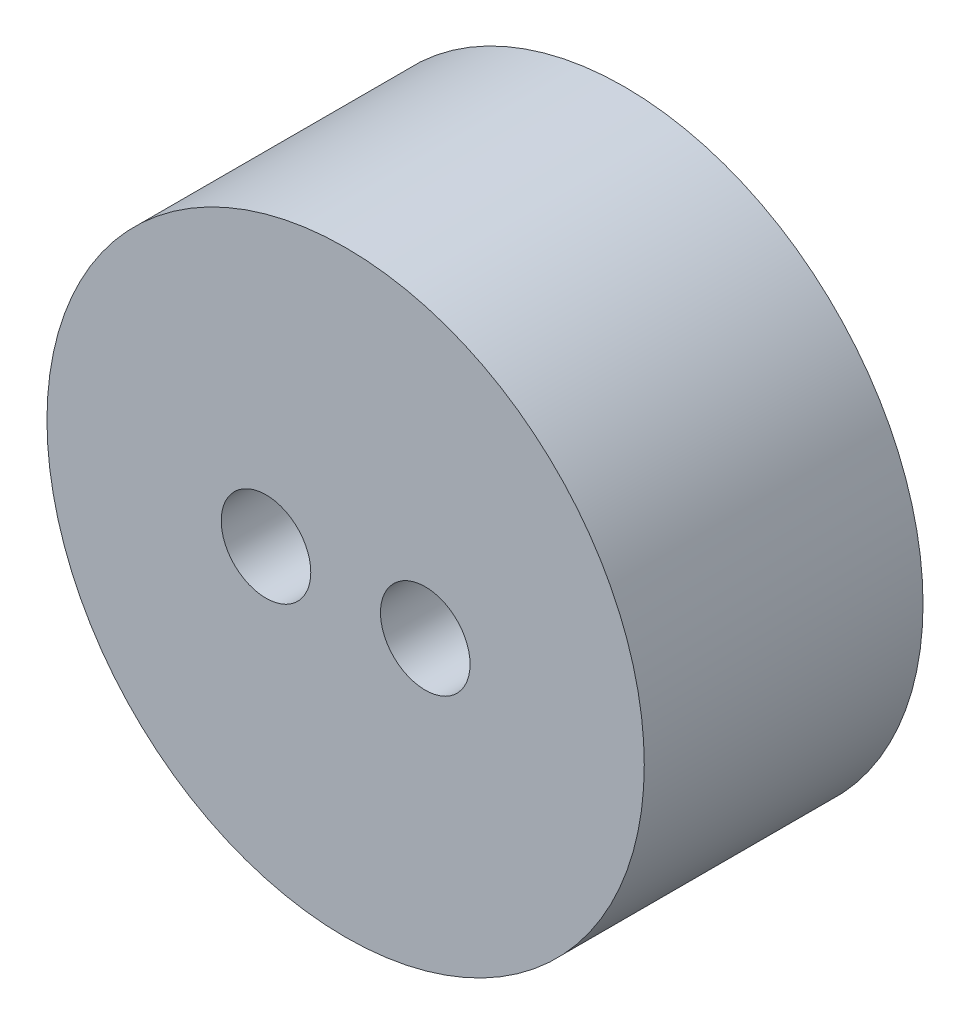
ISO-10303-21;
HEADER;
FILE_DESCRIPTION(('STEP AP214'),'2;1');
FILE_NAME('part.step','',(''),(''),'','','');
FILE_SCHEMA(('AUTOMOTIVE_DESIGN { 1 0 10303 214 1 1 1 1 }'));
ENDSEC;
DATA;
#1=APPLICATION_CONTEXT('core data for automotive mechanical design processes');
#2=APPLICATION_PROTOCOL_DEFINITION('international standard','automotive_design',2000,#1);
#3=PRODUCT_CONTEXT('',#1,'mechanical');
#4=PRODUCT('Part','Part','',(#3));
#5=PRODUCT_RELATED_PRODUCT_CATEGORY('part','',(#4));
#6=PRODUCT_DEFINITION_FORMATION('','',#4);
#7=PRODUCT_DEFINITION_CONTEXT('part definition',#1,'design');
#8=PRODUCT_DEFINITION('design','',#6,#7);
#9=PRODUCT_DEFINITION_SHAPE('','',#8);
#10=(LENGTH_UNIT() NAMED_UNIT(*) SI_UNIT(.MILLI.,.METRE.));
#11=(NAMED_UNIT(*) PLANE_ANGLE_UNIT() SI_UNIT($,.RADIAN.));
#12=(NAMED_UNIT(*) SI_UNIT($,.STERADIAN.) SOLID_ANGLE_UNIT());
#13=UNCERTAINTY_MEASURE_WITH_UNIT(LENGTH_MEASURE(1.E-05),#10,'distance_accuracy_value','');
#14=(GEOMETRIC_REPRESENTATION_CONTEXT(3) GLOBAL_UNCERTAINTY_ASSIGNED_CONTEXT((#13)) GLOBAL_UNIT_ASSIGNED_CONTEXT((#10,
#11,#12)) REPRESENTATION_CONTEXT('',''));
#15=CARTESIAN_POINT('',(0.,0.,0.));
#16=DIRECTION('',(0.,0.,1.));
#17=DIRECTION('',(1.,0.,0.));
#18=AXIS2_PLACEMENT_3D('',#15,#16,#17);
#19=CARTESIAN_POINT('',(0.,0.,14.));
#20=DIRECTION('',(0.,0.,-1.));
#21=DIRECTION('',(-1.,0.,0.));
#22=AXIS2_PLACEMENT_3D('',#19,#20,#21);
#23=CYLINDRICAL_SURFACE('',#22,15.);
#24=CARTESIAN_POINT('',(0.,0.,14.));
#25=DIRECTION('',(0.,0.,1.));
#26=DIRECTION('',(1.,0.,0.));
#27=AXIS2_PLACEMENT_3D('',#24,#25,#26);
#28=CIRCLE('',#27,15.);
#29=CARTESIAN_POINT('',(15.,0.,14.));
#30=VERTEX_POINT('',#29);
#31=EDGE_CURVE('E10',#30,#30,#28,.T.);
#32=ORIENTED_EDGE('',*,*,#31,.F.);
#33=EDGE_LOOP('',(#32));
#34=FACE_BOUND('',#33,.T.);
#35=CARTESIAN_POINT('',(0.,0.,0.));
#36=DIRECTION('',(0.,0.,1.));
#37=DIRECTION('',(1.,0.,0.));
#38=AXIS2_PLACEMENT_3D('',#35,#36,#37);
#39=CIRCLE('',#38,15.);
#40=CARTESIAN_POINT('',(15.,0.,0.));
#41=VERTEX_POINT('',#40);
#42=EDGE_CURVE('E34',#41,#41,#39,.T.);
#43=ORIENTED_EDGE('',*,*,#42,.T.);
#44=EDGE_LOOP('',(#43));
#45=FACE_BOUND('',#44,.T.);
#46=ADVANCED_FACE('F31',(#34,#45),#23,.T.);
#47=CARTESIAN_POINT('',(0.,0.,14.));
#48=DIRECTION('',(0.,0.,1.));
#49=DIRECTION('',(1.,0.,0.));
#50=AXIS2_PLACEMENT_3D('',#47,#48,#49);
#51=PLANE('',#50);
#52=CARTESIAN_POINT('',(-4.,0.,14.));
#53=DIRECTION('',(0.,0.,1.));
#54=DIRECTION('',(1.,0.,0.));
#55=AXIS2_PLACEMENT_3D('',#52,#53,#54);
#56=CIRCLE('',#55,2.25);
#57=CARTESIAN_POINT('',(-1.75,0.,14.));
#58=VERTEX_POINT('',#57);
#59=EDGE_CURVE('E51',#58,#58,#56,.T.);
#60=ORIENTED_EDGE('',*,*,#59,.F.);
#61=EDGE_LOOP('',(#60));
#62=FACE_BOUND('',#61,.T.);
#63=CARTESIAN_POINT('',(4.,0.,14.));
#64=DIRECTION('',(0.,0.,1.));
#65=DIRECTION('',(1.,0.,0.));
#66=AXIS2_PLACEMENT_3D('',#63,#64,#65);
#67=CIRCLE('',#66,2.25);
#68=CARTESIAN_POINT('',(6.25,0.,14.));
#69=VERTEX_POINT('',#68);
#70=EDGE_CURVE('E45',#69,#69,#67,.T.);
#71=ORIENTED_EDGE('',*,*,#70,.F.);
#72=EDGE_LOOP('',(#71));
#73=FACE_BOUND('',#72,.T.);
#74=ORIENTED_EDGE('',*,*,#31,.T.);
#75=EDGE_LOOP('',(#74));
#76=FACE_BOUND('',#75,.T.);
#77=ADVANCED_FACE('F57',(#62,#73,#76),#51,.T.);
#78=CARTESIAN_POINT('',(0.,0.,0.));
#79=DIRECTION('',(0.,0.,1.));
#80=DIRECTION('',(1.,0.,0.));
#81=AXIS2_PLACEMENT_3D('',#78,#79,#80);
#82=PLANE('',#81);
#83=CARTESIAN_POINT('',(-4.,0.,0.));
#84=DIRECTION('',(0.,0.,1.));
#85=DIRECTION('',(1.,0.,0.));
#86=AXIS2_PLACEMENT_3D('',#83,#84,#85);
#87=CIRCLE('',#86,2.25);
#88=CARTESIAN_POINT('',(-1.75,0.,0.));
#89=VERTEX_POINT('',#88);
#90=EDGE_CURVE('E48',#89,#89,#87,.T.);
#91=ORIENTED_EDGE('',*,*,#90,.T.);
#92=EDGE_LOOP('',(#91));
#93=FACE_BOUND('',#92,.T.);
#94=CARTESIAN_POINT('',(4.,0.,0.));
#95=DIRECTION('',(0.,0.,1.));
#96=DIRECTION('',(1.,0.,0.));
#97=AXIS2_PLACEMENT_3D('',#94,#95,#96);
#98=CIRCLE('',#97,2.25);
#99=CARTESIAN_POINT('',(6.25,0.,0.));
#100=VERTEX_POINT('',#99);
#101=EDGE_CURVE('E41',#100,#100,#98,.T.);
#102=ORIENTED_EDGE('',*,*,#101,.T.);
#103=EDGE_LOOP('',(#102));
#104=FACE_BOUND('',#103,.T.);
#105=ORIENTED_EDGE('',*,*,#42,.F.);
#106=EDGE_LOOP('',(#105));
#107=FACE_BOUND('',#106,.T.);
#108=ADVANCED_FACE('F60',(#93,#104,#107),#82,.F.);
#109=CARTESIAN_POINT('',(4.,0.,14.));
#110=DIRECTION('',(0.,0.,1.));
#111=DIRECTION('',(1.,0.,0.));
#112=AXIS2_PLACEMENT_3D('',#109,#110,#111);
#113=CYLINDRICAL_SURFACE('',#112,2.25);
#114=ORIENTED_EDGE('',*,*,#101,.F.);
#115=EDGE_LOOP('',(#114));
#116=FACE_BOUND('',#115,.T.);
#117=ORIENTED_EDGE('',*,*,#70,.T.);
#118=EDGE_LOOP('',(#117));
#119=FACE_BOUND('',#118,.T.);
#120=ADVANCED_FACE('F64',(#116,#119),#113,.F.);
#121=CARTESIAN_POINT('',(-4.,0.,14.));
#122=DIRECTION('',(0.,0.,1.));
#123=DIRECTION('',(1.,0.,0.));
#124=AXIS2_PLACEMENT_3D('',#121,#122,#123);
#125=CYLINDRICAL_SURFACE('',#124,2.25);
#126=ORIENTED_EDGE('',*,*,#90,.F.);
#127=EDGE_LOOP('',(#126));
#128=FACE_BOUND('',#127,.T.);
#129=ORIENTED_EDGE('',*,*,#59,.T.);
#130=EDGE_LOOP('',(#129));
#131=FACE_BOUND('',#130,.T.);
#132=ADVANCED_FACE('F55',(#128,#131),#125,.F.);
#133=CLOSED_SHELL('',(#46,#77,#108,#120,#132));
#134=MANIFOLD_SOLID_BREP('B2',#133);
#135=ADVANCED_BREP_SHAPE_REPRESENTATION('',(#18,#134),#14);
#136=SHAPE_DEFINITION_REPRESENTATION(#9,#135);
ENDSEC;
END-ISO-10303-21;
